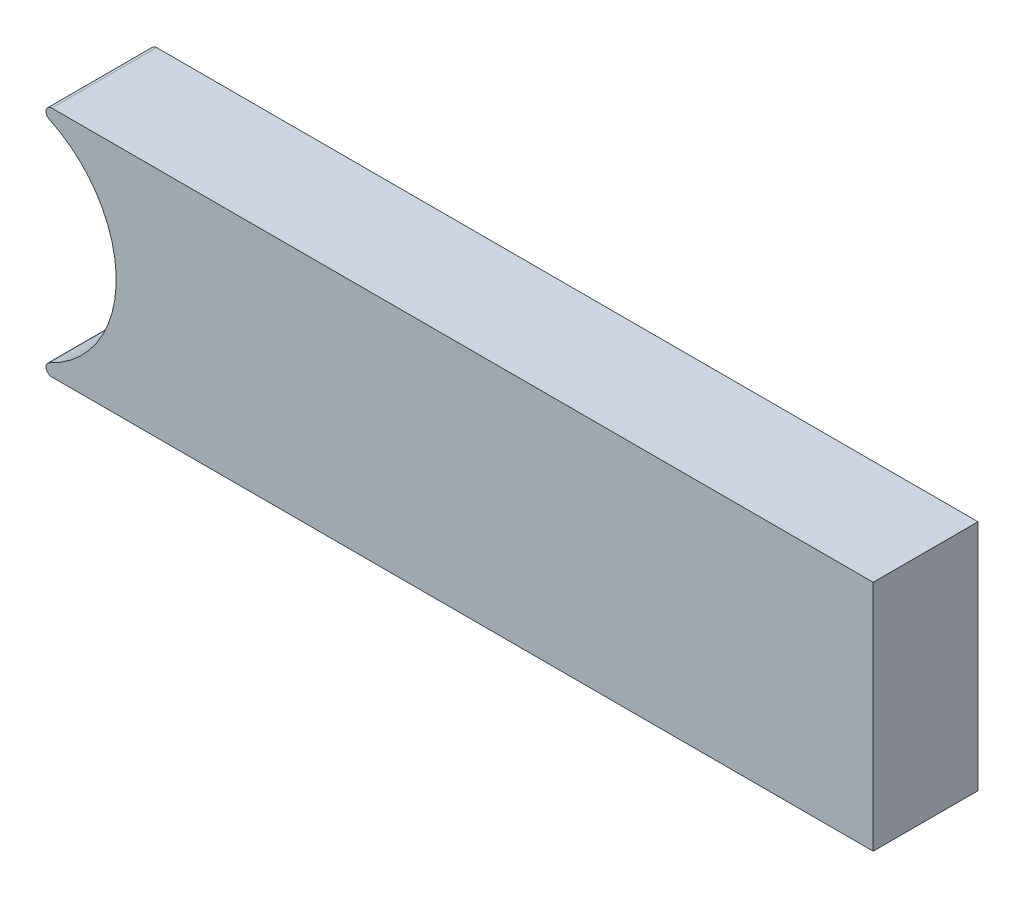
ISO-10303-21;
HEADER;
FILE_DESCRIPTION(('STEP AP214'),'2;1');
FILE_NAME('part.step','',(''),(''),'','','');
FILE_SCHEMA(('AUTOMOTIVE_DESIGN { 1 0 10303 214 1 1 1 1 }'));
ENDSEC;
DATA;
#1=APPLICATION_CONTEXT('core data for automotive mechanical design processes');
#2=APPLICATION_PROTOCOL_DEFINITION('international standard','automotive_design',2000,#1);
#3=PRODUCT_CONTEXT('',#1,'mechanical');
#4=PRODUCT('Part','Part','',(#3));
#5=PRODUCT_RELATED_PRODUCT_CATEGORY('part','',(#4));
#6=PRODUCT_DEFINITION_FORMATION('','',#4);
#7=PRODUCT_DEFINITION_CONTEXT('part definition',#1,'design');
#8=PRODUCT_DEFINITION('design','',#6,#7);
#9=PRODUCT_DEFINITION_SHAPE('','',#8);
#10=(LENGTH_UNIT() NAMED_UNIT(*) SI_UNIT(.MILLI.,.METRE.));
#11=(NAMED_UNIT(*) PLANE_ANGLE_UNIT() SI_UNIT($,.RADIAN.));
#12=(NAMED_UNIT(*) SI_UNIT($,.STERADIAN.) SOLID_ANGLE_UNIT());
#13=UNCERTAINTY_MEASURE_WITH_UNIT(LENGTH_MEASURE(1.E-05),#10,'distance_accuracy_value','');
#14=(GEOMETRIC_REPRESENTATION_CONTEXT(3) GLOBAL_UNCERTAINTY_ASSIGNED_CONTEXT((#13)) GLOBAL_UNIT_ASSIGNED_CONTEXT((#10,
#11,#12)) REPRESENTATION_CONTEXT('',''));
#15=CARTESIAN_POINT('',(0.,0.,0.));
#16=DIRECTION('',(0.,0.,1.));
#17=DIRECTION('',(1.,0.,0.));
#18=AXIS2_PLACEMENT_3D('',#15,#16,#17);
#19=CARTESIAN_POINT('',(0.,0.,1.8));
#20=DIRECTION('',(0.,0.,-1.));
#21=DIRECTION('',(-1.,0.,0.));
#22=AXIS2_PLACEMENT_3D('',#19,#20,#21);
#23=CYLINDRICAL_SURFACE('',#22,2.);
#24=CARTESIAN_POINT('',(0.,0.,1.8));
#25=DIRECTION('',(0.,0.,-1.));
#26=DIRECTION('',(1.,0.,0.));
#27=AXIS2_PLACEMENT_3D('',#24,#25,#26);
#28=CIRCLE('',#27,2.);
#29=CARTESIAN_POINT('',(0.85183541999992,1.80952380952381,1.8));
#30=VERTEX_POINT('',#29);
#31=CARTESIAN_POINT('',(0.85183541999992,-1.80952380952381,1.8));
#32=VERTEX_POINT('',#31);
#33=EDGE_CURVE('E118',#30,#32,#28,.T.);
#34=ORIENTED_EDGE('',*,*,#33,.F.);
#35=DIRECTION('',(0.,0.,-1.));
#36=VECTOR('',#35,1.);
#37=CARTESIAN_POINT('',(0.85183541999992,1.80952380952381,1.8));
#38=LINE('',#37,#36);
#39=CARTESIAN_POINT('',(0.85183541999992,1.80952380952381,0.));
#40=VERTEX_POINT('',#39);
#41=EDGE_CURVE('E156',#30,#40,#38,.T.);
#42=ORIENTED_EDGE('',*,*,#41,.T.);
#43=CARTESIAN_POINT('',(0.,0.,0.));
#44=DIRECTION('',(0.,0.,-1.));
#45=DIRECTION('',(1.,0.,0.));
#46=AXIS2_PLACEMENT_3D('',#43,#44,#45);
#47=CIRCLE('',#46,2.);
#48=CARTESIAN_POINT('',(0.85183541999992,-1.80952380952381,0.));
#49=VERTEX_POINT('',#48);
#50=EDGE_CURVE('E141',#40,#49,#47,.T.);
#51=ORIENTED_EDGE('',*,*,#50,.T.);
#52=DIRECTION('',(0.,0.,-1.));
#53=VECTOR('',#52,1.);
#54=CARTESIAN_POINT('',(0.85183541999992,-1.80952380952381,1.8));
#55=LINE('',#54,#53);
#56=EDGE_CURVE('E128',#49,#32,#55,.F.);
#57=ORIENTED_EDGE('',*,*,#56,.T.);
#58=EDGE_LOOP('',(#34,#42,#51,#57));
#59=FACE_BOUND('',#58,.T.);
#60=ADVANCED_FACE('F43',(#59),#23,.F.);
#61=CARTESIAN_POINT('',(15.,-2.,1.8));
#62=DIRECTION('',(0.,1.,0.));
#63=DIRECTION('',(-1.,0.,0.));
#64=AXIS2_PLACEMENT_3D('',#61,#62,#63);
#65=PLANE('',#64);
#66=DIRECTION('',(1.,0.,0.));
#67=VECTOR('',#66,1.);
#68=CARTESIAN_POINT('',(15.,-2.,1.8));
#69=LINE('',#68,#67);
#70=CARTESIAN_POINT('',(0.894427190999915,-2.,1.8));
#71=VERTEX_POINT('',#70);
#72=CARTESIAN_POINT('',(15.,-2.,1.8));
#73=VERTEX_POINT('',#72);
#74=EDGE_CURVE('E109',#71,#73,#69,.T.);
#75=ORIENTED_EDGE('',*,*,#74,.F.);
#76=DIRECTION('',(0.,0.,-1.));
#77=VECTOR('',#76,1.);
#78=CARTESIAN_POINT('',(0.894427190999915,-2.,1.8));
#79=LINE('',#78,#77);
#80=CARTESIAN_POINT('',(0.894427190999915,-2.,0.));
#81=VERTEX_POINT('',#80);
#82=EDGE_CURVE('E11',#71,#81,#79,.T.);
#83=ORIENTED_EDGE('',*,*,#82,.T.);
#84=DIRECTION('',(1.,0.,0.));
#85=VECTOR('',#84,1.);
#86=CARTESIAN_POINT('',(15.,-2.,0.));
#87=LINE('',#86,#85);
#88=CARTESIAN_POINT('',(15.,-2.,0.));
#89=VERTEX_POINT('',#88);
#90=EDGE_CURVE('E124',#81,#89,#87,.T.);
#91=ORIENTED_EDGE('',*,*,#90,.T.);
#92=DIRECTION('',(0.,0.,-1.));
#93=VECTOR('',#92,1.);
#94=CARTESIAN_POINT('',(15.,-2.,1.8));
#95=LINE('',#94,#93);
#96=EDGE_CURVE('E121',#73,#89,#95,.T.);
#97=ORIENTED_EDGE('',*,*,#96,.F.);
#98=EDGE_LOOP('',(#75,#83,#91,#97));
#99=FACE_BOUND('',#98,.T.);
#100=ADVANCED_FACE('F122',(#99),#65,.F.);
#101=CARTESIAN_POINT('',(15.,2.,1.8));
#102=DIRECTION('',(-1.,0.,0.));
#103=DIRECTION('',(0.,0.,1.));
#104=AXIS2_PLACEMENT_3D('',#101,#102,#103);
#105=PLANE('',#104);
#106=DIRECTION('',(0.,1.,0.));
#107=VECTOR('',#106,1.);
#108=CARTESIAN_POINT('',(15.,2.,0.));
#109=LINE('',#108,#107);
#110=CARTESIAN_POINT('',(15.,2.,0.));
#111=VERTEX_POINT('',#110);
#112=EDGE_CURVE('E147',#89,#111,#109,.T.);
#113=ORIENTED_EDGE('',*,*,#112,.T.);
#114=DIRECTION('',(0.,0.,-1.));
#115=VECTOR('',#114,1.);
#116=CARTESIAN_POINT('',(15.,2.,1.8));
#117=LINE('',#116,#115);
#118=CARTESIAN_POINT('',(15.,2.,1.8));
#119=VERTEX_POINT('',#118);
#120=EDGE_CURVE('E129',#119,#111,#117,.T.);
#121=ORIENTED_EDGE('',*,*,#120,.F.);
#122=DIRECTION('',(0.,1.,0.));
#123=VECTOR('',#122,1.);
#124=CARTESIAN_POINT('',(15.,2.,1.8));
#125=LINE('',#124,#123);
#126=EDGE_CURVE('E113',#73,#119,#125,.T.);
#127=ORIENTED_EDGE('',*,*,#126,.F.);
#128=ORIENTED_EDGE('',*,*,#96,.T.);
#129=EDGE_LOOP('',(#113,#121,#127,#128));
#130=FACE_BOUND('',#129,.T.);
#131=ADVANCED_FACE('F131',(#130),#105,.F.);
#132=CARTESIAN_POINT('',(0.,2.,1.8));
#133=DIRECTION('',(0.,-1.,0.));
#134=DIRECTION('',(1.,0.,0.));
#135=AXIS2_PLACEMENT_3D('',#132,#133,#134);
#136=PLANE('',#135);
#137=DIRECTION('',(-1.,0.,0.));
#138=VECTOR('',#137,1.);
#139=CARTESIAN_POINT('',(0.,2.,0.));
#140=LINE('',#139,#138);
#141=CARTESIAN_POINT('',(0.894427190999916,2.,0.));
#142=VERTEX_POINT('',#141);
#143=EDGE_CURVE('E149',#111,#142,#140,.T.);
#144=ORIENTED_EDGE('',*,*,#143,.T.);
#145=DIRECTION('',(0.,0.,-1.));
#146=VECTOR('',#145,1.);
#147=CARTESIAN_POINT('',(0.894427190999916,2.,1.8));
#148=LINE('',#147,#146);
#149=CARTESIAN_POINT('',(0.894427190999916,2.,1.8));
#150=VERTEX_POINT('',#149);
#151=EDGE_CURVE('E72',#142,#150,#148,.F.);
#152=ORIENTED_EDGE('',*,*,#151,.T.);
#153=DIRECTION('',(-1.,0.,0.));
#154=VECTOR('',#153,1.);
#155=CARTESIAN_POINT('',(0.,2.,1.8));
#156=LINE('',#155,#154);
#157=EDGE_CURVE('E134',#119,#150,#156,.T.);
#158=ORIENTED_EDGE('',*,*,#157,.F.);
#159=ORIENTED_EDGE('',*,*,#120,.T.);
#160=EDGE_LOOP('',(#144,#152,#158,#159));
#161=FACE_BOUND('',#160,.T.);
#162=ADVANCED_FACE('F182',(#161),#136,.F.);
#163=CARTESIAN_POINT('',(0.,0.,1.8));
#164=DIRECTION('',(0.,0.,1.));
#165=DIRECTION('',(1.,0.,0.));
#166=AXIS2_PLACEMENT_3D('',#163,#164,#165);
#167=PLANE('',#166);
#168=ORIENTED_EDGE('',*,*,#157,.T.);
#169=CARTESIAN_POINT('',(0.894427190999916,1.9,1.8));
#170=DIRECTION('',(0.,0.,1.));
#171=DIRECTION('',(1.,0.,0.));
#172=AXIS2_PLACEMENT_3D('',#169,#170,#171);
#173=CIRCLE('',#172,0.1);
#174=EDGE_CURVE('E52',#150,#30,#173,.T.);
#175=ORIENTED_EDGE('',*,*,#174,.T.);
#176=ORIENTED_EDGE('',*,*,#33,.T.);
#177=CARTESIAN_POINT('',(0.894427190999916,-1.9,1.8));
#178=DIRECTION('',(0.,0.,1.));
#179=DIRECTION('',(1.,0.,0.));
#180=AXIS2_PLACEMENT_3D('',#177,#178,#179);
#181=CIRCLE('',#180,0.1);
#182=EDGE_CURVE('E62',#32,#71,#181,.T.);
#183=ORIENTED_EDGE('',*,*,#182,.T.);
#184=ORIENTED_EDGE('',*,*,#74,.T.);
#185=ORIENTED_EDGE('',*,*,#126,.T.);
#186=EDGE_LOOP('',(#168,#175,#176,#183,#184,#185));
#187=FACE_BOUND('',#186,.T.);
#188=ADVANCED_FACE('F111',(#187),#167,.T.);
#189=CARTESIAN_POINT('',(0.,0.,0.));
#190=DIRECTION('',(0.,0.,1.));
#191=DIRECTION('',(1.,0.,0.));
#192=AXIS2_PLACEMENT_3D('',#189,#190,#191);
#193=PLANE('',#192);
#194=ORIENTED_EDGE('',*,*,#50,.F.);
#195=CARTESIAN_POINT('',(0.894427190999916,1.9,0.));
#196=DIRECTION('',(0.,0.,1.));
#197=DIRECTION('',(1.,0.,0.));
#198=AXIS2_PLACEMENT_3D('',#195,#196,#197);
#199=CIRCLE('',#198,0.1);
#200=EDGE_CURVE('E163',#40,#142,#199,.F.);
#201=ORIENTED_EDGE('',*,*,#200,.T.);
#202=ORIENTED_EDGE('',*,*,#143,.F.);
#203=ORIENTED_EDGE('',*,*,#112,.F.);
#204=ORIENTED_EDGE('',*,*,#90,.F.);
#205=CARTESIAN_POINT('',(0.894427190999916,-1.9,0.));
#206=DIRECTION('',(0.,0.,1.));
#207=DIRECTION('',(1.,0.,0.));
#208=AXIS2_PLACEMENT_3D('',#205,#206,#207);
#209=CIRCLE('',#208,0.1);
#210=EDGE_CURVE('E160',#81,#49,#209,.F.);
#211=ORIENTED_EDGE('',*,*,#210,.T.);
#212=EDGE_LOOP('',(#194,#201,#202,#203,#204,#211));
#213=FACE_BOUND('',#212,.T.);
#214=ADVANCED_FACE('F181',(#213),#193,.F.);
#215=CARTESIAN_POINT('',(0.894427190999916,1.9,1.8));
#216=DIRECTION('',(0.,0.,-1.));
#217=DIRECTION('',(-1.,0.,0.));
#218=AXIS2_PLACEMENT_3D('',#215,#216,#217);
#219=CYLINDRICAL_SURFACE('',#218,0.1);
#220=ORIENTED_EDGE('',*,*,#174,.F.);
#221=ORIENTED_EDGE('',*,*,#151,.F.);
#222=ORIENTED_EDGE('',*,*,#200,.F.);
#223=ORIENTED_EDGE('',*,*,#41,.F.);
#224=EDGE_LOOP('',(#220,#221,#222,#223));
#225=FACE_BOUND('',#224,.T.);
#226=ADVANCED_FACE('F178',(#225),#219,.T.);
#227=CARTESIAN_POINT('',(0.894427190999916,-1.9,1.8));
#228=DIRECTION('',(0.,0.,-1.));
#229=DIRECTION('',(-1.,0.,0.));
#230=AXIS2_PLACEMENT_3D('',#227,#228,#229);
#231=CYLINDRICAL_SURFACE('',#230,0.1);
#232=ORIENTED_EDGE('',*,*,#182,.F.);
#233=ORIENTED_EDGE('',*,*,#56,.F.);
#234=ORIENTED_EDGE('',*,*,#210,.F.);
#235=ORIENTED_EDGE('',*,*,#82,.F.);
#236=EDGE_LOOP('',(#232,#233,#234,#235));
#237=FACE_BOUND('',#236,.T.);
#238=ADVANCED_FACE('F45',(#237),#231,.T.);
#239=CLOSED_SHELL('',(#60,#100,#131,#162,#188,#214,#226,#238));
#240=MANIFOLD_SOLID_BREP('B2',#239);
#241=ADVANCED_BREP_SHAPE_REPRESENTATION('',(#18,#240),#14);
#242=SHAPE_DEFINITION_REPRESENTATION(#9,#241);
ENDSEC;
END-ISO-10303-21;
